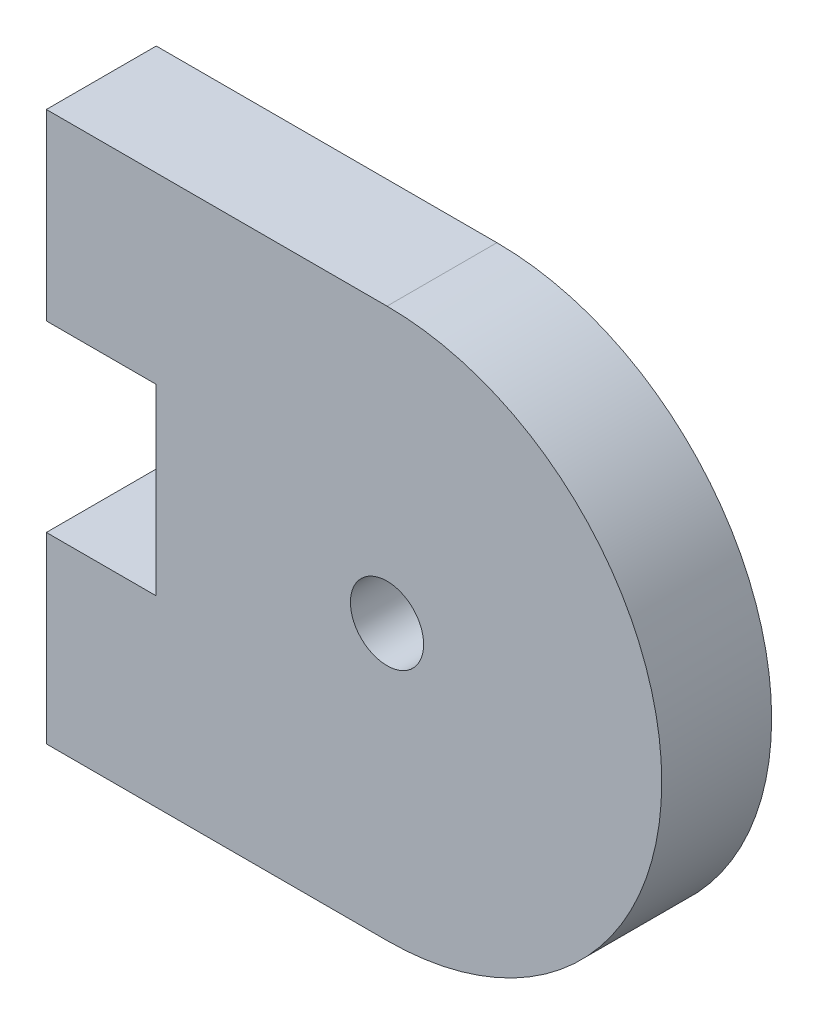
ISO-10303-21;
HEADER;
FILE_DESCRIPTION(('STEP AP214'),'2;1');
FILE_NAME('part.step','',(''),(''),'','','');
FILE_SCHEMA(('AUTOMOTIVE_DESIGN { 1 0 10303 214 1 1 1 1 }'));
ENDSEC;
DATA;
#1=APPLICATION_CONTEXT('core data for automotive mechanical design processes');
#2=APPLICATION_PROTOCOL_DEFINITION('international standard','automotive_design',2000,#1);
#3=PRODUCT_CONTEXT('',#1,'mechanical');
#4=PRODUCT('Part','Part','',(#3));
#5=PRODUCT_RELATED_PRODUCT_CATEGORY('part','',(#4));
#6=PRODUCT_DEFINITION_FORMATION('','',#4);
#7=PRODUCT_DEFINITION_CONTEXT('part definition',#1,'design');
#8=PRODUCT_DEFINITION('design','',#6,#7);
#9=PRODUCT_DEFINITION_SHAPE('','',#8);
#10=(LENGTH_UNIT() NAMED_UNIT(*) SI_UNIT(.MILLI.,.METRE.));
#11=(NAMED_UNIT(*) PLANE_ANGLE_UNIT() SI_UNIT($,.RADIAN.));
#12=(NAMED_UNIT(*) SI_UNIT($,.STERADIAN.) SOLID_ANGLE_UNIT());
#13=UNCERTAINTY_MEASURE_WITH_UNIT(LENGTH_MEASURE(1.E-05),#10,'distance_accuracy_value','');
#14=(GEOMETRIC_REPRESENTATION_CONTEXT(3) GLOBAL_UNCERTAINTY_ASSIGNED_CONTEXT((#13)) GLOBAL_UNIT_ASSIGNED_CONTEXT((#10,
#11,#12)) REPRESENTATION_CONTEXT('',''));
#15=CARTESIAN_POINT('',(0.,0.,0.));
#16=DIRECTION('',(0.,0.,1.));
#17=DIRECTION('',(1.,0.,0.));
#18=AXIS2_PLACEMENT_3D('',#15,#16,#17);
#19=CARTESIAN_POINT('',(35.9599999999989,18.866878763506,3.));
#20=DIRECTION('',(0.,0.,1.));
#21=DIRECTION('',(1.,0.,0.));
#22=AXIS2_PLACEMENT_3D('',#19,#20,#21);
#23=PLANE('',#22);
#24=CARTESIAN_POINT('',(35.9599999999989,18.866878763506,3.));
#25=DIRECTION('',(0.,0.,1.));
#26=DIRECTION('',(1.,0.,0.));
#27=AXIS2_PLACEMENT_3D('',#24,#25,#26);
#28=CIRCLE('',#27,7.50000000000006);
#29=CARTESIAN_POINT('',(35.9599999999989,11.3668787635058,3.));
#30=VERTEX_POINT('',#29);
#31=CARTESIAN_POINT('',(35.9599999999989,26.366878763506,3.));
#32=VERTEX_POINT('',#31);
#33=EDGE_CURVE('E145',#30,#32,#28,.T.);
#34=ORIENTED_EDGE('',*,*,#33,.T.);
#35=DIRECTION('',(-1.,0.,0.));
#36=VECTOR('',#35,1.);
#37=CARTESIAN_POINT('',(35.9599999999989,26.366878763506,3.));
#38=LINE('',#37,#36);
#39=CARTESIAN_POINT('',(26.660000000001,26.366878763506,3.));
#40=VERTEX_POINT('',#39);
#41=EDGE_CURVE('E93',#32,#40,#38,.T.);
#42=ORIENTED_EDGE('',*,*,#41,.T.);
#43=DIRECTION('',(0.,-1.,0.));
#44=VECTOR('',#43,1.);
#45=CARTESIAN_POINT('',(26.660000000001,21.3668787635064,3.));
#46=LINE('',#45,#44);
#47=CARTESIAN_POINT('',(26.660000000001,21.3668787635064,3.));
#48=VERTEX_POINT('',#47);
#49=EDGE_CURVE('E161',#40,#48,#46,.T.);
#50=ORIENTED_EDGE('',*,*,#49,.T.);
#51=DIRECTION('',(1.,0.,0.));
#52=VECTOR('',#51,1.);
#53=CARTESIAN_POINT('',(26.660000000001,21.3668787635064,3.));
#54=LINE('',#53,#52);
#55=CARTESIAN_POINT('',(29.6600000000001,21.3668787635065,3.));
#56=VERTEX_POINT('',#55);
#57=EDGE_CURVE('E173',#48,#56,#54,.T.);
#58=ORIENTED_EDGE('',*,*,#57,.T.);
#59=DIRECTION('',(0.,-1.,0.));
#60=VECTOR('',#59,1.);
#61=CARTESIAN_POINT('',(29.6600000000001,21.3668787635065,3.));
#62=LINE('',#61,#60);
#63=CARTESIAN_POINT('',(29.6600000000001,16.366878763506,3.));
#64=VERTEX_POINT('',#63);
#65=EDGE_CURVE('E112',#56,#64,#62,.T.);
#66=ORIENTED_EDGE('',*,*,#65,.T.);
#67=DIRECTION('',(-1.,0.,0.));
#68=VECTOR('',#67,1.);
#69=CARTESIAN_POINT('',(29.6600000000001,16.366878763506,3.));
#70=LINE('',#69,#68);
#71=CARTESIAN_POINT('',(26.660000000001,16.366878763506,3.));
#72=VERTEX_POINT('',#71);
#73=EDGE_CURVE('E106',#64,#72,#70,.T.);
#74=ORIENTED_EDGE('',*,*,#73,.T.);
#75=DIRECTION('',(0.,-1.,0.));
#76=VECTOR('',#75,1.);
#77=CARTESIAN_POINT('',(26.660000000001,16.366878763506,3.));
#78=LINE('',#77,#76);
#79=CARTESIAN_POINT('',(26.660000000001,11.3668787635058,3.));
#80=VERTEX_POINT('',#79);
#81=EDGE_CURVE('E110',#72,#80,#78,.T.);
#82=ORIENTED_EDGE('',*,*,#81,.T.);
#83=DIRECTION('',(1.,0.,0.));
#84=VECTOR('',#83,1.);
#85=CARTESIAN_POINT('',(26.660000000001,11.3668787635058,3.));
#86=LINE('',#85,#84);
#87=EDGE_CURVE('E50',#80,#30,#86,.T.);
#88=ORIENTED_EDGE('',*,*,#87,.T.);
#89=EDGE_LOOP('',(#34,#42,#50,#58,#66,#74,#82,#88));
#90=FACE_BOUND('',#89,.T.);
#91=CARTESIAN_POINT('',(35.9599999999989,18.866878763506,3.));
#92=DIRECTION('',(0.,0.,1.));
#93=DIRECTION('',(1.,0.,0.));
#94=AXIS2_PLACEMENT_3D('',#91,#92,#93);
#95=CIRCLE('',#94,1.);
#96=CARTESIAN_POINT('',(36.9599999999989,18.866878763506,3.));
#97=VERTEX_POINT('',#96);
#98=EDGE_CURVE('E134',#97,#97,#95,.T.);
#99=ORIENTED_EDGE('',*,*,#98,.F.);
#100=EDGE_LOOP('',(#99));
#101=FACE_BOUND('',#100,.T.);
#102=ADVANCED_FACE('F32',(#90,#101),#23,.T.);
#103=CARTESIAN_POINT('',(35.9599999999989,18.866878763506,0.));
#104=DIRECTION('',(0.,0.,1.));
#105=DIRECTION('',(1.,0.,0.));
#106=AXIS2_PLACEMENT_3D('',#103,#104,#105);
#107=PLANE('',#106);
#108=CARTESIAN_POINT('',(35.9599999999989,18.866878763506,0.));
#109=DIRECTION('',(0.,0.,1.));
#110=DIRECTION('',(1.,0.,0.));
#111=AXIS2_PLACEMENT_3D('',#108,#109,#110);
#112=CIRCLE('',#111,2.14999999999999);
#113=CARTESIAN_POINT('',(38.1099999999989,18.866878763506,0.));
#114=VERTEX_POINT('',#113);
#115=EDGE_CURVE('E181',#114,#114,#112,.T.);
#116=ORIENTED_EDGE('',*,*,#115,.T.);
#117=EDGE_LOOP('',(#116));
#118=FACE_BOUND('',#117,.T.);
#119=CARTESIAN_POINT('',(35.9599999999989,18.866878763506,0.));
#120=DIRECTION('',(0.,0.,1.));
#121=DIRECTION('',(1.,0.,0.));
#122=AXIS2_PLACEMENT_3D('',#119,#120,#121);
#123=CIRCLE('',#122,7.50000000000006);
#124=CARTESIAN_POINT('',(35.9599999999989,11.3668787635058,0.));
#125=VERTEX_POINT('',#124);
#126=CARTESIAN_POINT('',(35.9599999999989,26.366878763506,0.));
#127=VERTEX_POINT('',#126);
#128=EDGE_CURVE('E130',#125,#127,#123,.T.);
#129=ORIENTED_EDGE('',*,*,#128,.F.);
#130=DIRECTION('',(1.,0.,0.));
#131=VECTOR('',#130,1.);
#132=CARTESIAN_POINT('',(26.660000000001,11.3668787635058,0.));
#133=LINE('',#132,#131);
#134=CARTESIAN_POINT('',(26.660000000001,11.3668787635058,0.));
#135=VERTEX_POINT('',#134);
#136=EDGE_CURVE('E85',#135,#125,#133,.T.);
#137=ORIENTED_EDGE('',*,*,#136,.F.);
#138=DIRECTION('',(0.,-1.,0.));
#139=VECTOR('',#138,1.);
#140=CARTESIAN_POINT('',(26.660000000001,16.366878763506,0.));
#141=LINE('',#140,#139);
#142=CARTESIAN_POINT('',(26.660000000001,16.366878763506,0.));
#143=VERTEX_POINT('',#142);
#144=EDGE_CURVE('E79',#143,#135,#141,.T.);
#145=ORIENTED_EDGE('',*,*,#144,.F.);
#146=DIRECTION('',(-1.,0.,0.));
#147=VECTOR('',#146,1.);
#148=CARTESIAN_POINT('',(29.6600000000001,16.366878763506,0.));
#149=LINE('',#148,#147);
#150=CARTESIAN_POINT('',(29.6600000000001,16.366878763506,0.));
#151=VERTEX_POINT('',#150);
#152=EDGE_CURVE('E120',#151,#143,#149,.T.);
#153=ORIENTED_EDGE('',*,*,#152,.F.);
#154=DIRECTION('',(0.,-1.,0.));
#155=VECTOR('',#154,1.);
#156=CARTESIAN_POINT('',(29.6600000000001,21.3668787635065,0.));
#157=LINE('',#156,#155);
#158=CARTESIAN_POINT('',(29.6600000000001,21.3668787635065,0.));
#159=VERTEX_POINT('',#158);
#160=EDGE_CURVE('E140',#159,#151,#157,.T.);
#161=ORIENTED_EDGE('',*,*,#160,.F.);
#162=DIRECTION('',(1.,0.,0.));
#163=VECTOR('',#162,1.);
#164=CARTESIAN_POINT('',(26.660000000001,21.3668787635064,0.));
#165=LINE('',#164,#163);
#166=CARTESIAN_POINT('',(26.660000000001,21.3668787635064,0.));
#167=VERTEX_POINT('',#166);
#168=EDGE_CURVE('E138',#167,#159,#165,.T.);
#169=ORIENTED_EDGE('',*,*,#168,.F.);
#170=DIRECTION('',(0.,-1.,0.));
#171=VECTOR('',#170,1.);
#172=CARTESIAN_POINT('',(26.660000000001,21.3668787635064,0.));
#173=LINE('',#172,#171);
#174=CARTESIAN_POINT('',(26.660000000001,26.366878763506,0.));
#175=VERTEX_POINT('',#174);
#176=EDGE_CURVE('E136',#175,#167,#173,.T.);
#177=ORIENTED_EDGE('',*,*,#176,.F.);
#178=DIRECTION('',(-1.,0.,0.));
#179=VECTOR('',#178,1.);
#180=CARTESIAN_POINT('',(35.9599999999989,26.366878763506,0.));
#181=LINE('',#180,#179);
#182=EDGE_CURVE('E133',#127,#175,#181,.T.);
#183=ORIENTED_EDGE('',*,*,#182,.F.);
#184=EDGE_LOOP('',(#129,#137,#145,#153,#161,#169,#177,#183));
#185=FACE_BOUND('',#184,.T.);
#186=ADVANCED_FACE('F165',(#118,#185),#107,.F.);
#187=CARTESIAN_POINT('',(35.9599999999989,18.866878763506,3.));
#188=DIRECTION('',(0.,0.,-1.));
#189=DIRECTION('',(-1.,0.,0.));
#190=AXIS2_PLACEMENT_3D('',#187,#188,#189);
#191=CYLINDRICAL_SURFACE('',#190,7.50000000000006);
#192=ORIENTED_EDGE('',*,*,#128,.T.);
#193=DIRECTION('',(0.,0.,-1.));
#194=VECTOR('',#193,1.);
#195=CARTESIAN_POINT('',(35.9599999999989,26.366878763506,3.));
#196=LINE('',#195,#194);
#197=EDGE_CURVE('E11',#32,#127,#196,.T.);
#198=ORIENTED_EDGE('',*,*,#197,.F.);
#199=ORIENTED_EDGE('',*,*,#33,.F.);
#200=DIRECTION('',(0.,0.,-1.));
#201=VECTOR('',#200,1.);
#202=CARTESIAN_POINT('',(35.9599999999989,11.3668787635058,3.));
#203=LINE('',#202,#201);
#204=EDGE_CURVE('E126',#30,#125,#203,.T.);
#205=ORIENTED_EDGE('',*,*,#204,.T.);
#206=EDGE_LOOP('',(#192,#198,#199,#205));
#207=FACE_BOUND('',#206,.T.);
#208=ADVANCED_FACE('F34',(#207),#191,.T.);
#209=CARTESIAN_POINT('',(35.9599999999989,26.366878763506,3.));
#210=DIRECTION('',(0.,-1.,0.));
#211=DIRECTION('',(1.,0.,0.));
#212=AXIS2_PLACEMENT_3D('',#209,#210,#211);
#213=PLANE('',#212);
#214=ORIENTED_EDGE('',*,*,#182,.T.);
#215=DIRECTION('',(0.,0.,-1.));
#216=VECTOR('',#215,1.);
#217=CARTESIAN_POINT('',(26.660000000001,26.366878763506,3.));
#218=LINE('',#217,#216);
#219=EDGE_CURVE('E42',#40,#175,#218,.T.);
#220=ORIENTED_EDGE('',*,*,#219,.F.);
#221=ORIENTED_EDGE('',*,*,#41,.F.);
#222=ORIENTED_EDGE('',*,*,#197,.T.);
#223=EDGE_LOOP('',(#214,#220,#221,#222));
#224=FACE_BOUND('',#223,.T.);
#225=ADVANCED_FACE('F221',(#224),#213,.F.);
#226=CARTESIAN_POINT('',(26.660000000001,21.3668787635064,3.));
#227=DIRECTION('',(1.,0.,0.));
#228=DIRECTION('',(0.,0.,-1.));
#229=AXIS2_PLACEMENT_3D('',#226,#227,#228);
#230=PLANE('',#229);
#231=ORIENTED_EDGE('',*,*,#176,.T.);
#232=DIRECTION('',(0.,0.,-1.));
#233=VECTOR('',#232,1.);
#234=CARTESIAN_POINT('',(26.660000000001,21.3668787635064,3.));
#235=LINE('',#234,#233);
#236=EDGE_CURVE('E152',#48,#167,#235,.T.);
#237=ORIENTED_EDGE('',*,*,#236,.F.);
#238=ORIENTED_EDGE('',*,*,#49,.F.);
#239=ORIENTED_EDGE('',*,*,#219,.T.);
#240=EDGE_LOOP('',(#231,#237,#238,#239));
#241=FACE_BOUND('',#240,.T.);
#242=ADVANCED_FACE('F159',(#241),#230,.F.);
#243=CARTESIAN_POINT('',(26.660000000001,21.3668787635064,3.));
#244=DIRECTION('',(0.,1.,0.));
#245=DIRECTION('',(-1.,0.,0.));
#246=AXIS2_PLACEMENT_3D('',#243,#244,#245);
#247=PLANE('',#246);
#248=ORIENTED_EDGE('',*,*,#168,.T.);
#249=DIRECTION('',(0.,0.,-1.));
#250=VECTOR('',#249,1.);
#251=CARTESIAN_POINT('',(29.6600000000001,21.3668787635065,3.));
#252=LINE('',#251,#250);
#253=EDGE_CURVE('E149',#56,#159,#252,.T.);
#254=ORIENTED_EDGE('',*,*,#253,.F.);
#255=ORIENTED_EDGE('',*,*,#57,.F.);
#256=ORIENTED_EDGE('',*,*,#236,.T.);
#257=EDGE_LOOP('',(#248,#254,#255,#256));
#258=FACE_BOUND('',#257,.T.);
#259=ADVANCED_FACE('F169',(#258),#247,.F.);
#260=CARTESIAN_POINT('',(29.6600000000001,21.3668787635065,3.));
#261=DIRECTION('',(1.,0.,0.));
#262=DIRECTION('',(0.,0.,-1.));
#263=AXIS2_PLACEMENT_3D('',#260,#261,#262);
#264=PLANE('',#263);
#265=ORIENTED_EDGE('',*,*,#160,.T.);
#266=DIRECTION('',(0.,0.,-1.));
#267=VECTOR('',#266,1.);
#268=CARTESIAN_POINT('',(29.6600000000001,16.366878763506,3.));
#269=LINE('',#268,#267);
#270=EDGE_CURVE('E121',#64,#151,#269,.T.);
#271=ORIENTED_EDGE('',*,*,#270,.F.);
#272=ORIENTED_EDGE('',*,*,#65,.F.);
#273=ORIENTED_EDGE('',*,*,#253,.T.);
#274=EDGE_LOOP('',(#265,#271,#272,#273));
#275=FACE_BOUND('',#274,.T.);
#276=ADVANCED_FACE('F172',(#275),#264,.F.);
#277=CARTESIAN_POINT('',(29.6600000000001,16.366878763506,3.));
#278=DIRECTION('',(0.,-1.,0.));
#279=DIRECTION('',(0.,0.,-1.));
#280=AXIS2_PLACEMENT_3D('',#277,#278,#279);
#281=PLANE('',#280);
#282=ORIENTED_EDGE('',*,*,#152,.T.);
#283=DIRECTION('',(0.,0.,-1.));
#284=VECTOR('',#283,1.);
#285=CARTESIAN_POINT('',(26.660000000001,16.366878763506,3.));
#286=LINE('',#285,#284);
#287=EDGE_CURVE('E117',#72,#143,#286,.T.);
#288=ORIENTED_EDGE('',*,*,#287,.F.);
#289=ORIENTED_EDGE('',*,*,#73,.F.);
#290=ORIENTED_EDGE('',*,*,#270,.T.);
#291=EDGE_LOOP('',(#282,#288,#289,#290));
#292=FACE_BOUND('',#291,.T.);
#293=ADVANCED_FACE('F118',(#292),#281,.F.);
#294=CARTESIAN_POINT('',(26.660000000001,16.366878763506,3.));
#295=DIRECTION('',(1.,0.,0.));
#296=DIRECTION('',(0.,0.,-1.));
#297=AXIS2_PLACEMENT_3D('',#294,#295,#296);
#298=PLANE('',#297);
#299=ORIENTED_EDGE('',*,*,#144,.T.);
#300=DIRECTION('',(0.,0.,-1.));
#301=VECTOR('',#300,1.);
#302=CARTESIAN_POINT('',(26.660000000001,11.3668787635058,3.));
#303=LINE('',#302,#301);
#304=EDGE_CURVE('E122',#80,#135,#303,.T.);
#305=ORIENTED_EDGE('',*,*,#304,.F.);
#306=ORIENTED_EDGE('',*,*,#81,.F.);
#307=ORIENTED_EDGE('',*,*,#287,.T.);
#308=EDGE_LOOP('',(#299,#305,#306,#307));
#309=FACE_BOUND('',#308,.T.);
#310=ADVANCED_FACE('F124',(#309),#298,.F.);
#311=CARTESIAN_POINT('',(26.660000000001,11.3668787635058,3.));
#312=DIRECTION('',(0.,1.,0.));
#313=DIRECTION('',(0.,0.,1.));
#314=AXIS2_PLACEMENT_3D('',#311,#312,#313);
#315=PLANE('',#314);
#316=ORIENTED_EDGE('',*,*,#136,.T.);
#317=ORIENTED_EDGE('',*,*,#204,.F.);
#318=ORIENTED_EDGE('',*,*,#87,.F.);
#319=ORIENTED_EDGE('',*,*,#304,.T.);
#320=EDGE_LOOP('',(#316,#317,#318,#319));
#321=FACE_BOUND('',#320,.T.);
#322=ADVANCED_FACE('F198',(#321),#315,.F.);
#323=CARTESIAN_POINT('',(35.9599999999989,18.866878763506,3.));
#324=DIRECTION('',(0.,0.,-1.));
#325=DIRECTION('',(-1.,0.,0.));
#326=AXIS2_PLACEMENT_3D('',#323,#324,#325);
#327=CYLINDRICAL_SURFACE('',#326,1.);
#328=CARTESIAN_POINT('',(35.9599999999989,18.866878763506,1.));
#329=DIRECTION('',(0.,0.,1.));
#330=DIRECTION('',(1.,0.,0.));
#331=AXIS2_PLACEMENT_3D('',#328,#329,#330);
#332=CIRCLE('',#331,1.);
#333=CARTESIAN_POINT('',(36.9599999999989,18.866878763506,1.));
#334=VERTEX_POINT('',#333);
#335=EDGE_CURVE('E36',#334,#334,#332,.T.);
#336=ORIENTED_EDGE('',*,*,#335,.F.);
#337=EDGE_LOOP('',(#336));
#338=FACE_BOUND('',#337,.T.);
#339=ORIENTED_EDGE('',*,*,#98,.T.);
#340=EDGE_LOOP('',(#339));
#341=FACE_BOUND('',#340,.T.);
#342=ADVANCED_FACE('F194',(#338,#341),#327,.F.);
#343=CARTESIAN_POINT('',(35.9599999999989,18.866878763506,1.));
#344=DIRECTION('',(0.,0.,-1.));
#345=DIRECTION('',(-1.,0.,0.));
#346=AXIS2_PLACEMENT_3D('',#343,#344,#345);
#347=CYLINDRICAL_SURFACE('',#346,2.14999999999999);
#348=CARTESIAN_POINT('',(35.9599999999989,18.866878763506,1.));
#349=DIRECTION('',(0.,0.,1.));
#350=DIRECTION('',(1.,0.,0.));
#351=AXIS2_PLACEMENT_3D('',#348,#349,#350);
#352=CIRCLE('',#351,2.14999999999999);
#353=CARTESIAN_POINT('',(38.1099999999989,18.866878763506,1.));
#354=VERTEX_POINT('',#353);
#355=EDGE_CURVE('E184',#354,#354,#352,.T.);
#356=ORIENTED_EDGE('',*,*,#355,.T.);
#357=EDGE_LOOP('',(#356));
#358=FACE_BOUND('',#357,.T.);
#359=ORIENTED_EDGE('',*,*,#115,.F.);
#360=EDGE_LOOP('',(#359));
#361=FACE_BOUND('',#360,.T.);
#362=ADVANCED_FACE('F197',(#358,#361),#347,.F.);
#363=CARTESIAN_POINT('',(35.9599999999989,18.866878763506,1.));
#364=DIRECTION('',(0.,0.,1.));
#365=DIRECTION('',(1.,0.,0.));
#366=AXIS2_PLACEMENT_3D('',#363,#364,#365);
#367=PLANE('',#366);
#368=ORIENTED_EDGE('',*,*,#335,.T.);
#369=EDGE_LOOP('',(#368));
#370=FACE_BOUND('',#369,.T.);
#371=ORIENTED_EDGE('',*,*,#355,.F.);
#372=EDGE_LOOP('',(#371));
#373=FACE_BOUND('',#372,.T.);
#374=ADVANCED_FACE('F191',(#370,#373),#367,.F.);
#375=CLOSED_SHELL('',(#102,#186,#208,#225,#242,#259,#276,#293,#310,#322,#342,#362,#374));
#376=MANIFOLD_SOLID_BREP('B2',#375);
#377=ADVANCED_BREP_SHAPE_REPRESENTATION('',(#18,#376),#14);
#378=SHAPE_DEFINITION_REPRESENTATION(#9,#377);
ENDSEC;
END-ISO-10303-21;
